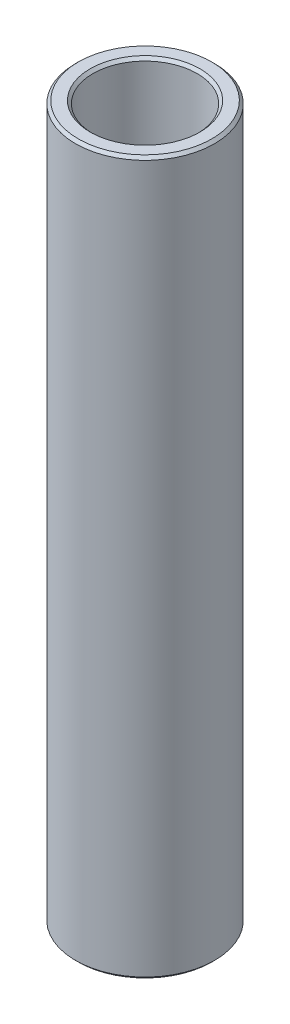
ISO-10303-21;
HEADER;
FILE_DESCRIPTION(('STEP AP214'),'2;1');
FILE_NAME('part.step','',(''),(''),'','','');
FILE_SCHEMA(('AUTOMOTIVE_DESIGN { 1 0 10303 214 1 1 1 1 }'));
ENDSEC;
DATA;
#1=APPLICATION_CONTEXT('core data for automotive mechanical design processes');
#2=APPLICATION_PROTOCOL_DEFINITION('international standard','automotive_design',2000,#1);
#3=PRODUCT_CONTEXT('',#1,'mechanical');
#4=PRODUCT('Part','Part','',(#3));
#5=PRODUCT_RELATED_PRODUCT_CATEGORY('part','',(#4));
#6=PRODUCT_DEFINITION_FORMATION('','',#4);
#7=PRODUCT_DEFINITION_CONTEXT('part definition',#1,'design');
#8=PRODUCT_DEFINITION('design','',#6,#7);
#9=PRODUCT_DEFINITION_SHAPE('','',#8);
#10=(LENGTH_UNIT() NAMED_UNIT(*) SI_UNIT(.MILLI.,.METRE.));
#11=(NAMED_UNIT(*) PLANE_ANGLE_UNIT() SI_UNIT($,.RADIAN.));
#12=(NAMED_UNIT(*) SI_UNIT($,.STERADIAN.) SOLID_ANGLE_UNIT());
#13=UNCERTAINTY_MEASURE_WITH_UNIT(LENGTH_MEASURE(1.E-05),#10,'distance_accuracy_value','');
#14=(GEOMETRIC_REPRESENTATION_CONTEXT(3) GLOBAL_UNCERTAINTY_ASSIGNED_CONTEXT((#13)) GLOBAL_UNIT_ASSIGNED_CONTEXT((#10,
#11,#12)) REPRESENTATION_CONTEXT('',''));
#15=CARTESIAN_POINT('',(0.,0.,0.));
#16=DIRECTION('',(0.,0.,1.));
#17=DIRECTION('',(1.,0.,0.));
#18=AXIS2_PLACEMENT_3D('',#15,#16,#17);
#19=CARTESIAN_POINT('',(6.35000000000029,63.2988530550458,0.));
#20=DIRECTION('',(0.,-1.,0.));
#21=DIRECTION('',(1.,0.,0.));
#22=AXIS2_PLACEMENT_3D('',#19,#20,#21);
#23=PLANE('',#22);
#24=CARTESIAN_POINT('',(0.,63.2988530550458,0.));
#25=DIRECTION('',(0.,-1.,0.));
#26=DIRECTION('',(1.,0.,0.));
#27=AXIS2_PLACEMENT_3D('',#24,#25,#26);
#28=CIRCLE('',#27,5.0165);
#29=CARTESIAN_POINT('',(5.01650000000001,63.2988530550458,0.));
#30=VERTEX_POINT('',#29);
#31=EDGE_CURVE('E10',#30,#30,#28,.F.);
#32=ORIENTED_EDGE('',*,*,#31,.T.);
#33=EDGE_LOOP('',(#32));
#34=FACE_BOUND('',#33,.T.);
#35=CARTESIAN_POINT('',(0.,63.2988530550458,0.));
#36=DIRECTION('',(0.,-1.,0.));
#37=DIRECTION('',(1.,0.,0.));
#38=AXIS2_PLACEMENT_3D('',#35,#36,#37);
#39=CIRCLE('',#38,6.09600000000028);
#40=CARTESIAN_POINT('',(6.09600000000029,63.2988530550458,0.));
#41=VERTEX_POINT('',#40);
#42=EDGE_CURVE('E38',#41,#41,#39,.T.);
#43=ORIENTED_EDGE('',*,*,#42,.T.);
#44=EDGE_LOOP('',(#43));
#45=FACE_BOUND('',#44,.T.);
#46=ADVANCED_FACE('F31',(#34,#45),#23,.T.);
#47=CARTESIAN_POINT('',(0.,53.7738530550458,0.));
#48=DIRECTION('',(0.,-1.,0.));
#49=DIRECTION('',(1.,0.,0.));
#50=AXIS2_PLACEMENT_3D('',#47,#48,#49);
#51=CYLINDRICAL_SURFACE('',#50,4.76249999999999);
#52=CARTESIAN_POINT('',(0.,128.180287266942,0.));
#53=DIRECTION('',(0.,1.,0.));
#54=DIRECTION('',(-1.,0.,0.));
#55=AXIS2_PLACEMENT_3D('',#52,#53,#54);
#56=CIRCLE('',#55,4.76249999999999);
#57=CARTESIAN_POINT('',(-4.76249999999994,128.180287266942,0.));
#58=VERTEX_POINT('',#57);
#59=EDGE_CURVE('E42',#58,#58,#56,.T.);
#60=ORIENTED_EDGE('',*,*,#59,.T.);
#61=EDGE_LOOP('',(#60));
#62=FACE_BOUND('',#61,.T.);
#63=CARTESIAN_POINT('',(0.,63.5528530550458,0.));
#64=DIRECTION('',(0.,-1.,0.));
#65=DIRECTION('',(1.,0.,0.));
#66=AXIS2_PLACEMENT_3D('',#63,#64,#65);
#67=CIRCLE('',#66,4.76249999999999);
#68=CARTESIAN_POINT('',(4.76249999999999,63.5528530550458,0.));
#69=VERTEX_POINT('',#68);
#70=EDGE_CURVE('E46',#69,#69,#67,.T.);
#71=ORIENTED_EDGE('',*,*,#70,.T.);
#72=EDGE_LOOP('',(#71));
#73=FACE_BOUND('',#72,.T.);
#74=ADVANCED_FACE('F75',(#62,#73),#51,.F.);
#75=CARTESIAN_POINT('',(4.76250000000001,128.434287266942,0.));
#76=DIRECTION('',(0.,1.,0.));
#77=DIRECTION('',(-1.,0.,0.));
#78=AXIS2_PLACEMENT_3D('',#75,#76,#77);
#79=PLANE('',#78);
#80=CARTESIAN_POINT('',(0.,128.434287266942,0.));
#81=DIRECTION('',(0.,1.,0.));
#82=DIRECTION('',(-1.,0.,0.));
#83=AXIS2_PLACEMENT_3D('',#80,#81,#82);
#84=CIRCLE('',#83,6.0960000000002);
#85=CARTESIAN_POINT('',(-6.09600000000016,128.434287266942,0.));
#86=VERTEX_POINT('',#85);
#87=EDGE_CURVE('E51',#86,#86,#84,.T.);
#88=ORIENTED_EDGE('',*,*,#87,.T.);
#89=EDGE_LOOP('',(#88));
#90=FACE_BOUND('',#89,.T.);
#91=CARTESIAN_POINT('',(0.,128.434287266942,0.));
#92=DIRECTION('',(0.,1.,0.));
#93=DIRECTION('',(-1.,0.,0.));
#94=AXIS2_PLACEMENT_3D('',#91,#92,#93);
#95=CIRCLE('',#94,5.01649999999999);
#96=CARTESIAN_POINT('',(-5.01649999999994,128.434287266942,0.));
#97=VERTEX_POINT('',#96);
#98=EDGE_CURVE('E54',#97,#97,#95,.F.);
#99=ORIENTED_EDGE('',*,*,#98,.T.);
#100=EDGE_LOOP('',(#99));
#101=FACE_BOUND('',#100,.T.);
#102=ADVANCED_FACE('F80',(#90,#101),#79,.T.);
#103=CARTESIAN_POINT('',(0.,53.7738530550458,0.));
#104=DIRECTION('',(0.,-1.,0.));
#105=DIRECTION('',(1.,0.,0.));
#106=AXIS2_PLACEMENT_3D('',#103,#104,#105);
#107=CYLINDRICAL_SURFACE('',#106,6.35000000000025);
#108=CARTESIAN_POINT('',(0.,128.180287266942,0.));
#109=DIRECTION('',(0.,1.,0.));
#110=DIRECTION('',(-1.,0.,0.));
#111=AXIS2_PLACEMENT_3D('',#108,#109,#110);
#112=CIRCLE('',#111,6.35000000000025);
#113=CARTESIAN_POINT('',(-6.3500000000002,128.180287266942,0.));
#114=VERTEX_POINT('',#113);
#115=EDGE_CURVE('E57',#114,#114,#112,.F.);
#116=ORIENTED_EDGE('',*,*,#115,.T.);
#117=EDGE_LOOP('',(#116));
#118=FACE_BOUND('',#117,.T.);
#119=CARTESIAN_POINT('',(0.,63.5528530550457,0.));
#120=DIRECTION('',(0.,-1.,0.));
#121=DIRECTION('',(1.,0.,0.));
#122=AXIS2_PLACEMENT_3D('',#119,#120,#121);
#123=CIRCLE('',#122,6.35000000000025);
#124=CARTESIAN_POINT('',(6.35000000000026,63.5528530550457,0.));
#125=VERTEX_POINT('',#124);
#126=EDGE_CURVE('E60',#125,#125,#123,.F.);
#127=ORIENTED_EDGE('',*,*,#126,.T.);
#128=EDGE_LOOP('',(#127));
#129=FACE_BOUND('',#128,.T.);
#130=ADVANCED_FACE('F64',(#118,#129),#107,.T.);
#131=CARTESIAN_POINT('',(0.,128.180287266942,0.));
#132=DIRECTION('',(0.,-1.,0.));
#133=DIRECTION('',(1.,0.,0.));
#134=AXIS2_PLACEMENT_3D('',#131,#132,#133);
#135=CONICAL_SURFACE('',#134,6.35000000000025,0.785398163397476);
#136=ORIENTED_EDGE('',*,*,#87,.F.);
#137=EDGE_LOOP('',(#136));
#138=FACE_BOUND('',#137,.T.);
#139=ORIENTED_EDGE('',*,*,#115,.F.);
#140=EDGE_LOOP('',(#139));
#141=FACE_BOUND('',#140,.T.);
#142=ADVANCED_FACE('F85',(#138,#141),#135,.T.);
#143=CARTESIAN_POINT('',(0.,128.434287266942,0.));
#144=DIRECTION('',(0.,1.,0.));
#145=DIRECTION('',(-1.,0.,0.));
#146=AXIS2_PLACEMENT_3D('',#143,#144,#145);
#147=CONICAL_SURFACE('',#146,5.01649999999998,0.785398163397436);
#148=ORIENTED_EDGE('',*,*,#59,.F.);
#149=EDGE_LOOP('',(#148));
#150=FACE_BOUND('',#149,.T.);
#151=ORIENTED_EDGE('',*,*,#98,.F.);
#152=EDGE_LOOP('',(#151));
#153=FACE_BOUND('',#152,.T.);
#154=ADVANCED_FACE('F72',(#150,#153),#147,.F.);
#155=CARTESIAN_POINT('',(0.,63.5528530550458,0.));
#156=DIRECTION('',(0.,-1.,0.));
#157=DIRECTION('',(1.,0.,0.));
#158=AXIS2_PLACEMENT_3D('',#155,#156,#157);
#159=CONICAL_SURFACE('',#158,4.76249999999999,0.785398163397476);
#160=ORIENTED_EDGE('',*,*,#31,.F.);
#161=EDGE_LOOP('',(#160));
#162=FACE_BOUND('',#161,.T.);
#163=ORIENTED_EDGE('',*,*,#70,.F.);
#164=EDGE_LOOP('',(#163));
#165=FACE_BOUND('',#164,.T.);
#166=ADVANCED_FACE('F68',(#162,#165),#159,.F.);
#167=CARTESIAN_POINT('',(0.,63.2988530550458,0.));
#168=DIRECTION('',(0.,1.,0.));
#169=DIRECTION('',(-1.,0.,0.));
#170=AXIS2_PLACEMENT_3D('',#167,#168,#169);
#171=CONICAL_SURFACE('',#170,6.09600000000028,0.785398163397448);
#172=ORIENTED_EDGE('',*,*,#126,.F.);
#173=EDGE_LOOP('',(#172));
#174=FACE_BOUND('',#173,.T.);
#175=ORIENTED_EDGE('',*,*,#42,.F.);
#176=EDGE_LOOP('',(#175));
#177=FACE_BOUND('',#176,.T.);
#178=ADVANCED_FACE('F33',(#174,#177),#171,.T.);
#179=CLOSED_SHELL('',(#46,#74,#102,#130,#142,#154,#166,#178));
#180=MANIFOLD_SOLID_BREP('B2',#179);
#181=ADVANCED_BREP_SHAPE_REPRESENTATION('',(#18,#180),#14);
#182=SHAPE_DEFINITION_REPRESENTATION(#9,#181);
ENDSEC;
END-ISO-10303-21;
